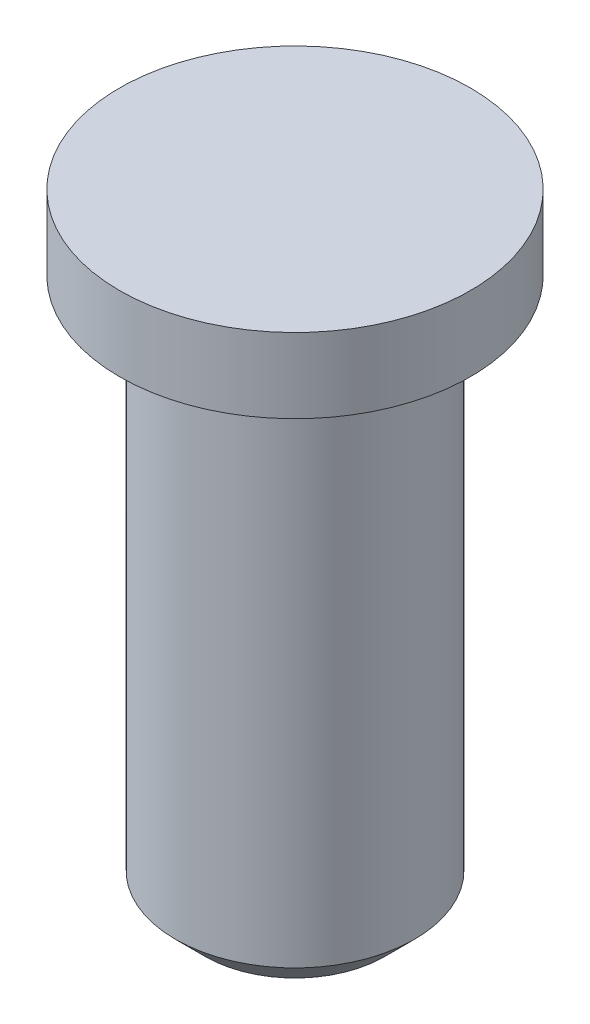
ISO-10303-21;
HEADER;
FILE_DESCRIPTION(('STEP AP214'),'2;1');
FILE_NAME('part.step','',(''),(''),'','','');
FILE_SCHEMA(('AUTOMOTIVE_DESIGN { 1 0 10303 214 1 1 1 1 }'));
ENDSEC;
DATA;
#1=APPLICATION_CONTEXT('core data for automotive mechanical design processes');
#2=APPLICATION_PROTOCOL_DEFINITION('international standard','automotive_design',2000,#1);
#3=PRODUCT_CONTEXT('',#1,'mechanical');
#4=PRODUCT('Part','Part','',(#3));
#5=PRODUCT_RELATED_PRODUCT_CATEGORY('part','',(#4));
#6=PRODUCT_DEFINITION_FORMATION('','',#4);
#7=PRODUCT_DEFINITION_CONTEXT('part definition',#1,'design');
#8=PRODUCT_DEFINITION('design','',#6,#7);
#9=PRODUCT_DEFINITION_SHAPE('','',#8);
#10=(LENGTH_UNIT() NAMED_UNIT(*) SI_UNIT(.MILLI.,.METRE.));
#11=(NAMED_UNIT(*) PLANE_ANGLE_UNIT() SI_UNIT($,.RADIAN.));
#12=(NAMED_UNIT(*) SI_UNIT($,.STERADIAN.) SOLID_ANGLE_UNIT());
#13=UNCERTAINTY_MEASURE_WITH_UNIT(LENGTH_MEASURE(1.E-05),#10,'distance_accuracy_value','');
#14=(GEOMETRIC_REPRESENTATION_CONTEXT(3) GLOBAL_UNCERTAINTY_ASSIGNED_CONTEXT((#13)) GLOBAL_UNIT_ASSIGNED_CONTEXT((#10,
#11,#12)) REPRESENTATION_CONTEXT('',''));
#15=CARTESIAN_POINT('',(0.,0.,0.));
#16=DIRECTION('',(0.,0.,1.));
#17=DIRECTION('',(1.,0.,0.));
#18=AXIS2_PLACEMENT_3D('',#15,#16,#17);
#19=CARTESIAN_POINT('',(0.,36.5,0.));
#20=DIRECTION('',(0.,-1.,0.));
#21=DIRECTION('',(0.,0.,-1.));
#22=AXIS2_PLACEMENT_3D('',#19,#20,#21);
#23=CYLINDRICAL_SURFACE('',#22,8.);
#24=CARTESIAN_POINT('',(0.,1.99999999999999,0.));
#25=DIRECTION('',(0.,1.,0.));
#26=DIRECTION('',(0.,0.,1.));
#27=AXIS2_PLACEMENT_3D('',#24,#25,#26);
#28=CIRCLE('',#27,8.);
#29=CARTESIAN_POINT('',(0.,1.99999999999999,8.));
#30=VERTEX_POINT('',#29);
#31=EDGE_CURVE('E37',#30,#30,#28,.T.);
#32=ORIENTED_EDGE('',*,*,#31,.T.);
#33=EDGE_LOOP('',(#32));
#34=FACE_BOUND('',#33,.T.);
#35=CARTESIAN_POINT('',(0.,36.5,0.));
#36=DIRECTION('',(0.,1.,0.));
#37=DIRECTION('',(0.,0.,1.));
#38=AXIS2_PLACEMENT_3D('',#35,#36,#37);
#39=CIRCLE('',#38,8.);
#40=CARTESIAN_POINT('',(0.,36.5,8.));
#41=VERTEX_POINT('',#40);
#42=EDGE_CURVE('E41',#41,#41,#39,.T.);
#43=ORIENTED_EDGE('',*,*,#42,.F.);
#44=EDGE_LOOP('',(#43));
#45=FACE_BOUND('',#44,.T.);
#46=ADVANCED_FACE('F30',(#34,#45),#23,.T.);
#47=CARTESIAN_POINT('',(0.,0.,0.));
#48=DIRECTION('',(0.,1.,0.));
#49=DIRECTION('',(0.,0.,1.));
#50=AXIS2_PLACEMENT_3D('',#47,#48,#49);
#51=PLANE('',#50);
#52=CARTESIAN_POINT('',(0.,0.,0.));
#53=DIRECTION('',(0.,1.,0.));
#54=DIRECTION('',(0.,0.,1.));
#55=AXIS2_PLACEMENT_3D('',#52,#53,#54);
#56=CIRCLE('',#55,6.);
#57=CARTESIAN_POINT('',(0.,0.,6.));
#58=VERTEX_POINT('',#57);
#59=EDGE_CURVE('E10',#58,#58,#56,.F.);
#60=ORIENTED_EDGE('',*,*,#59,.T.);
#61=EDGE_LOOP('',(#60));
#62=FACE_BOUND('',#61,.T.);
#63=ADVANCED_FACE('F71',(#62),#51,.F.);
#64=CARTESIAN_POINT('',(0.,1.99999999999999,0.));
#65=DIRECTION('',(0.,1.,0.));
#66=DIRECTION('',(0.,0.,1.));
#67=AXIS2_PLACEMENT_3D('',#64,#65,#66);
#68=CONICAL_SURFACE('',#67,8.,0.785398163397449);
#69=ORIENTED_EDGE('',*,*,#59,.F.);
#70=EDGE_LOOP('',(#69));
#71=FACE_BOUND('',#70,.T.);
#72=ORIENTED_EDGE('',*,*,#31,.F.);
#73=EDGE_LOOP('',(#72));
#74=FACE_BOUND('',#73,.T.);
#75=ADVANCED_FACE('F32',(#71,#74),#68,.T.);
#76=CARTESIAN_POINT('',(0.,41.5,0.));
#77=DIRECTION('',(0.,-1.,0.));
#78=DIRECTION('',(0.,0.,-1.));
#79=AXIS2_PLACEMENT_3D('',#76,#77,#78);
#80=CYLINDRICAL_SURFACE('',#79,11.75);
#81=CARTESIAN_POINT('',(0.,41.5,0.));
#82=DIRECTION('',(0.,1.,0.));
#83=DIRECTION('',(0.,0.,1.));
#84=AXIS2_PLACEMENT_3D('',#81,#82,#83);
#85=CIRCLE('',#84,11.75);
#86=CARTESIAN_POINT('',(0.,41.5,11.75));
#87=VERTEX_POINT('',#86);
#88=EDGE_CURVE('E45',#87,#87,#85,.T.);
#89=ORIENTED_EDGE('',*,*,#88,.F.);
#90=EDGE_LOOP('',(#89));
#91=FACE_BOUND('',#90,.T.);
#92=CARTESIAN_POINT('',(0.,36.5,0.));
#93=DIRECTION('',(0.,1.,0.));
#94=DIRECTION('',(0.,0.,1.));
#95=AXIS2_PLACEMENT_3D('',#92,#93,#94);
#96=CIRCLE('',#95,11.75);
#97=CARTESIAN_POINT('',(0.,36.5,11.75));
#98=VERTEX_POINT('',#97);
#99=EDGE_CURVE('E48',#98,#98,#96,.T.);
#100=ORIENTED_EDGE('',*,*,#99,.T.);
#101=EDGE_LOOP('',(#100));
#102=FACE_BOUND('',#101,.T.);
#103=ADVANCED_FACE('F56',(#91,#102),#80,.T.);
#104=CARTESIAN_POINT('',(0.,41.5,0.));
#105=DIRECTION('',(0.,1.,0.));
#106=DIRECTION('',(0.,0.,1.));
#107=AXIS2_PLACEMENT_3D('',#104,#105,#106);
#108=PLANE('',#107);
#109=ORIENTED_EDGE('',*,*,#88,.T.);
#110=EDGE_LOOP('',(#109));
#111=FACE_BOUND('',#110,.T.);
#112=ADVANCED_FACE('F54',(#111),#108,.T.);
#113=CARTESIAN_POINT('',(0.,36.5,0.));
#114=DIRECTION('',(0.,1.,0.));
#115=DIRECTION('',(0.,0.,1.));
#116=AXIS2_PLACEMENT_3D('',#113,#114,#115);
#117=PLANE('',#116);
#118=ORIENTED_EDGE('',*,*,#42,.T.);
#119=EDGE_LOOP('',(#118));
#120=FACE_BOUND('',#119,.T.);
#121=ORIENTED_EDGE('',*,*,#99,.F.);
#122=EDGE_LOOP('',(#121));
#123=FACE_BOUND('',#122,.T.);
#124=ADVANCED_FACE('F62',(#120,#123),#117,.F.);
#125=CLOSED_SHELL('',(#46,#63,#75,#103,#112,#124));
#126=MANIFOLD_SOLID_BREP('B2',#125);
#127=ADVANCED_BREP_SHAPE_REPRESENTATION('',(#18,#126),#14);
#128=SHAPE_DEFINITION_REPRESENTATION(#9,#127);
ENDSEC;
END-ISO-10303-21;
